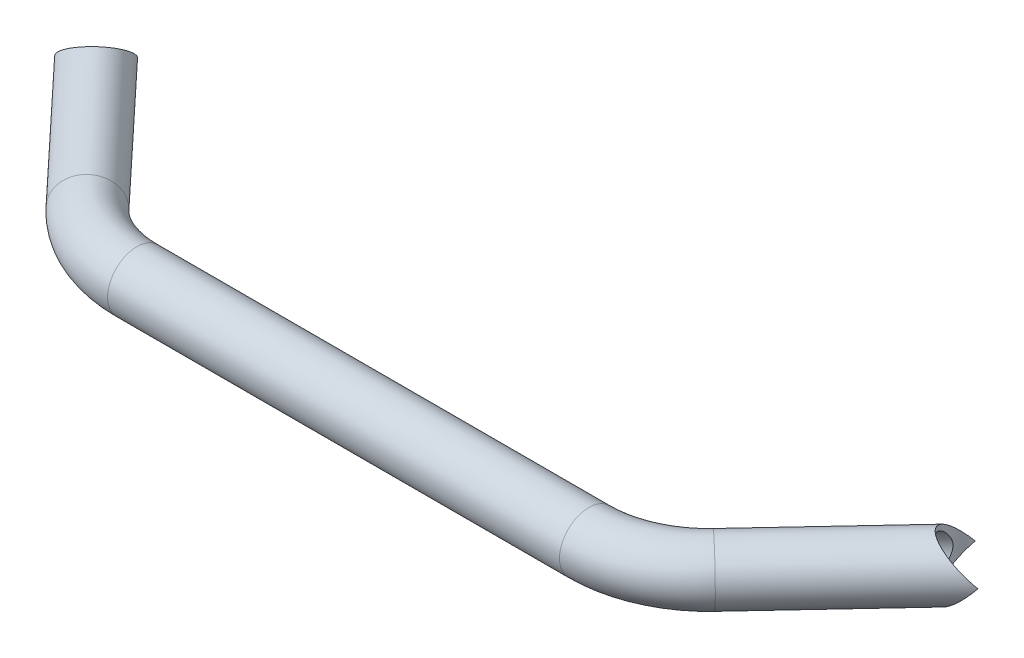
ISO-10303-21;
HEADER;
FILE_DESCRIPTION(('STEP AP214'),'2;1');
FILE_NAME('part.step','',(''),(''),'','','');
FILE_SCHEMA(('AUTOMOTIVE_DESIGN { 1 0 10303 214 1 1 1 1 }'));
ENDSEC;
DATA;
#1=APPLICATION_CONTEXT('core data for automotive mechanical design processes');
#2=APPLICATION_PROTOCOL_DEFINITION('international standard','automotive_design',2000,#1);
#3=PRODUCT_CONTEXT('',#1,'mechanical');
#4=PRODUCT('Part','Part','',(#3));
#5=PRODUCT_RELATED_PRODUCT_CATEGORY('part','',(#4));
#6=PRODUCT_DEFINITION_FORMATION('','',#4);
#7=PRODUCT_DEFINITION_CONTEXT('part definition',#1,'design');
#8=PRODUCT_DEFINITION('design','',#6,#7);
#9=PRODUCT_DEFINITION_SHAPE('','',#8);
#10=(LENGTH_UNIT() NAMED_UNIT(*) SI_UNIT(.MILLI.,.METRE.));
#11=(NAMED_UNIT(*) PLANE_ANGLE_UNIT() SI_UNIT($,.RADIAN.));
#12=(NAMED_UNIT(*) SI_UNIT($,.STERADIAN.) SOLID_ANGLE_UNIT());
#13=UNCERTAINTY_MEASURE_WITH_UNIT(LENGTH_MEASURE(1.E-05),#10,'distance_accuracy_value','');
#14=(GEOMETRIC_REPRESENTATION_CONTEXT(3) GLOBAL_UNCERTAINTY_ASSIGNED_CONTEXT((#13)) GLOBAL_UNIT_ASSIGNED_CONTEXT((#10,
#11,#12)) REPRESENTATION_CONTEXT('',''));
#15=CARTESIAN_POINT('',(0.,0.,0.));
#16=DIRECTION('',(0.,0.,1.));
#17=DIRECTION('',(1.,0.,0.));
#18=AXIS2_PLACEMENT_3D('',#15,#16,#17);
#19=CARTESIAN_POINT('',(-133.513784770512,0.,-15.1790258869227));
#20=DIRECTION('',(-0.683403377633146,0.,-0.730040973808736));
#21=DIRECTION('',(-0.730040973808736,0.,0.683403377633146));
#22=AXIS2_PLACEMENT_3D('',#19,#20,#21);
#23=CYLINDRICAL_SURFACE('',#22,12.5);
#24=CARTESIAN_POINT('',(-187.661320539916,0.,-73.0217598215196));
#25=DIRECTION('',(-0.483239162610188,0.707106781186547,-0.516216923124188));
#26=DIRECTION('',(-0.483239162610188,-0.707106781186547,-0.516216923124188));
#27=AXIS2_PLACEMENT_3D('',#24,#25,#26);
#28=ELLIPSE('',#27,17.6776695296637,12.5);
#29=CARTESIAN_POINT('',(-196.786832712525,0.,-64.4792176011055));
#30=VERTEX_POINT('',#29);
#31=CARTESIAN_POINT('',(-178.535808367306,0.,-81.5643020419338));
#32=VERTEX_POINT('',#31);
#33=EDGE_CURVE('E58',#30,#32,#28,.T.);
#34=ORIENTED_EDGE('',*,*,#33,.F.);
#35=CARTESIAN_POINT('',(-187.661320539916,0.,-73.0217598215196));
#36=DIRECTION('',(-0.483239162610188,-0.707106781186547,-0.516216923124188));
#37=DIRECTION('',(-0.483239162610188,0.707106781186547,-0.516216923124188));
#38=AXIS2_PLACEMENT_3D('',#35,#36,#37);
#39=ELLIPSE('',#38,17.6776695296637,12.5);
#40=EDGE_CURVE('E62',#32,#30,#39,.T.);
#41=ORIENTED_EDGE('',*,*,#40,.F.);
#42=EDGE_LOOP('',(#34,#41));
#43=FACE_BOUND('',#42,.T.);
#44=CARTESIAN_POINT('',(-133.513784770512,0.,-15.1790258869227));
#45=DIRECTION('',(-0.683403377633133,0.,-0.730040973808748));
#46=DIRECTION('',(-0.730040973808748,0.,0.683403377633133));
#47=AXIS2_PLACEMENT_3D('',#44,#45,#46);
#48=CIRCLE('',#47,12.5);
#49=CARTESIAN_POINT('',(-142.639296943121,0.,-6.63648366650837));
#50=VERTEX_POINT('',#49);
#51=EDGE_CURVE('E11',#50,#50,#48,.T.);
#52=ORIENTED_EDGE('',*,*,#51,.T.);
#53=EDGE_LOOP('',(#52));
#54=FACE_BOUND('',#53,.T.);
#55=ADVANCED_FACE('F34',(#43,#54),#23,.T.);
#56=CARTESIAN_POINT('',(-133.513784770512,0.,-15.1790258869227));
#57=DIRECTION('',(-0.683403377633146,0.,-0.730040973808736));
#58=DIRECTION('',(-0.730040973808736,0.,0.683403377633146));
#59=AXIS2_PLACEMENT_3D('',#56,#57,#58);
#60=CYLINDRICAL_SURFACE('',#59,10.5);
#61=CARTESIAN_POINT('',(-190.691683546217,0.,-60.8946455707986));
#62=CARTESIAN_POINT('',(-190.691678867242,0.183076877894322,-60.8946431981583));
#63=CARTESIAN_POINT('',(-190.683085642997,0.366193520833993,-60.8924870758773));
#64=CARTESIAN_POINT('',(-190.649082197047,0.730830359944528,-60.8840676127149));
#65=CARTESIAN_POINT('',(-190.623661925543,0.912349536355825,-60.8778018173895));
#66=CARTESIAN_POINT('',(-190.556981012901,1.27274647191603,-60.8617302066476));
#67=CARTESIAN_POINT('',(-190.515680187948,1.45161632507315,-60.8519154147103));
#68=CARTESIAN_POINT('',(-190.41872791826,1.80527300479625,-60.8295831532659));
#69=CARTESIAN_POINT('',(-190.363070757213,1.98005817464667,-60.8170646075194));
#70=CARTESIAN_POINT('',(-190.214499990628,2.39317857225525,-60.7849670826999));
#71=CARTESIAN_POINT('',(-190.115559688349,2.629282352519,-60.7645548291013));
#72=CARTESIAN_POINT('',(-189.89717656339,3.09171593856796,-60.7228452655316));
#73=CARTESIAN_POINT('',(-189.777722982499,3.31804053729898,-60.701547495615));
#74=CARTESIAN_POINT('',(-189.521541471281,3.76158603556164,-60.6602690731504));
#75=CARTESIAN_POINT('',(-189.384767099105,3.97878028748249,-60.6402921899981));
#76=CARTESIAN_POINT('',(-189.097021084997,4.40375175803055,-60.6036349244394));
#77=CARTESIAN_POINT('',(-188.946050176664,4.61152946243219,-60.5869543718346));
#78=CARTESIAN_POINT('',(-188.559012344029,5.11269527464846,-60.5518999671156));
#79=CARTESIAN_POINT('',(-188.316023804733,5.40095702601532,-60.5363465694721));
#80=CARTESIAN_POINT('',(-187.809109672135,5.95902012282276,-60.5200562720473));
#81=CARTESIAN_POINT('',(-187.545174773311,6.22881316319132,-60.5193259949202));
#82=CARTESIAN_POINT('',(-187.000313070078,6.74952567747122,-60.5362759102041));
#83=CARTESIAN_POINT('',(-186.719402721054,7.00046291636034,-60.5539385345394));
#84=CARTESIAN_POINT('',(-186.143442610168,7.48278379906874,-60.6108873145155));
#85=CARTESIAN_POINT('',(-185.84839840844,7.71417503471805,-60.6501650297149));
#86=CARTESIAN_POINT('',(-185.311653838395,8.10828342766437,-60.7422462910498));
#87=CARTESIAN_POINT('',(-185.072121979673,8.2750698646321,-60.7903265784011));
#88=CARTESIAN_POINT('',(-184.587552583054,8.59443434003217,-60.9030224238291));
#89=CARTESIAN_POINT('',(-184.342516192436,8.74701530574631,-60.9676345649011));
#90=CARTESIAN_POINT('',(-183.848866753886,9.03641227314824,-61.1145587891605));
#91=CARTESIAN_POINT('',(-183.600258505869,9.17324754499213,-61.1968488759009));
#92=CARTESIAN_POINT('',(-183.101105250075,9.42973405012039,-61.3802356454576));
#93=CARTESIAN_POINT('',(-182.850560608939,9.54938845634923,-61.4813288477977));
#94=CARTESIAN_POINT('',(-182.393639706652,9.75045283711552,-61.6836567073372));
#95=CARTESIAN_POINT('',(-182.187209543814,9.83489095057892,-61.7817684800896));
#96=CARTESIAN_POINT('',(-181.776018470762,9.98985408142831,-61.9915079037594));
#97=CARTESIAN_POINT('',(-181.571257227317,10.0603819449043,-62.1031327822856));
#98=CARTESIAN_POINT('',(-181.165027468443,10.1865433088686,-62.3398398074686));
#99=CARTESIAN_POINT('',(-180.963557832356,10.2421819821002,-62.4649172592592));
#100=CARTESIAN_POINT('',(-180.56552512045,10.3377366740758,-62.728236578923));
#101=CARTESIAN_POINT('',(-180.36896210069,10.3776525132613,-62.8664785971163));
#102=CARTESIAN_POINT('',(-179.981628906467,10.4412235969601,-63.1561090573689));
#103=CARTESIAN_POINT('',(-179.790888048294,10.4648064728236,-63.3075527027044));
#104=CARTESIAN_POINT('',(-179.417822775736,10.4949988922027,-63.6220648868246));
#105=CARTESIAN_POINT('',(-179.235498378845,10.5016084004411,-63.7851334497695));
#106=CARTESIAN_POINT('',(-178.880843494052,10.4977310780768,-64.1215929926601));
#107=CARTESIAN_POINT('',(-178.708512673741,10.4872448164555,-64.2949836288815));
#108=CARTESIAN_POINT('',(-178.375176918807,10.4493712785649,-64.6505639518116));
#109=CARTESIAN_POINT('',(-178.2141715678,10.4219846240063,-64.8327533146164));
#110=CARTESIAN_POINT('',(-177.915390251296,10.3533056204913,-65.1912159781894));
#111=CARTESIAN_POINT('',(-177.776777040389,10.3131239437921,-65.3670072705989));
#112=CARTESIAN_POINT('',(-177.510750927506,10.2191470603005,-65.7234443729141));
#113=CARTESIAN_POINT('',(-177.383341851558,10.1653472272677,-65.9040918138306));
#114=CARTESIAN_POINT('',(-177.140143355161,10.0448773020222,-66.2687712128298));
#115=CARTESIAN_POINT('',(-177.024350216447,9.97821134836499,-66.4528020654185));
#116=CARTESIAN_POINT('',(-176.804392135278,9.8327711405304,-66.8230898620992));
#117=CARTESIAN_POINT('',(-176.700231538205,9.75399238751347,-67.0093476094847));
#118=CARTESIAN_POINT('',(-176.49534678367,9.57818024841823,-67.3983052591088));
#119=CARTESIAN_POINT('',(-176.395618722391,9.4801761168201,-67.6010913917348));
#120=CARTESIAN_POINT('',(-176.209373960598,9.27197688007955,-68.0065070474837));
#121=CARTESIAN_POINT('',(-176.122862530318,9.16177694181388,-68.2091364762421));
#122=CARTESIAN_POINT('',(-175.882405436647,8.81424737752849,-68.8151217213007));
#123=CARTESIAN_POINT('',(-175.747534892699,8.55998616670185,-69.216578521075));
#124=CARTESIAN_POINT('',(-175.552594620589,8.0838202098739,-69.9037992227189));
#125=CARTESIAN_POINT('',(-175.482207051077,7.87043158409135,-70.19274529089));
#126=CARTESIAN_POINT('',(-175.364150215968,7.42432977950488,-70.7604373661672));
#127=CARTESIAN_POINT('',(-175.316491397739,7.19160777162733,-71.039178628348));
#128=CARTESIAN_POINT('',(-175.241241610902,6.7078048802031,-71.5839128877597));
#129=CARTESIAN_POINT('',(-175.213686128078,6.45669238967189,-71.8498825719006));
#130=CARTESIAN_POINT('',(-175.175893480546,5.9370483399469,-72.3654013650257));
#131=CARTESIAN_POINT('',(-175.165650332302,5.6685228324205,-72.6149561187113));
#132=CARTESIAN_POINT('',(-175.160044612395,5.18398429731532,-73.0331862286135));
#133=CARTESIAN_POINT('',(-175.161573590752,4.97186779883609,-73.2063535142342));
#134=CARTESIAN_POINT('',(-175.1709275164,4.53738573616562,-73.5392374603783));
#135=CARTESIAN_POINT('',(-175.178753000225,4.31501930008416,-73.6989529733746));
#136=CARTESIAN_POINT('',(-175.198873852476,3.86009720394399,-74.0017526466379));
#137=CARTESIAN_POINT('',(-175.211158623712,3.62756684061339,-74.1448751838282));
#138=CARTESIAN_POINT('',(-175.238057326688,3.15161932086739,-74.4111576192603));
#139=CARTESIAN_POINT('',(-175.252670038342,2.90820791507944,-74.5343279067639));
#140=CARTESIAN_POINT('',(-175.286220948771,2.33290340836182,-74.7904960025163));
#141=CARTESIAN_POINT('',(-175.305099358419,1.99692548613459,-74.9147542000733));
#142=CARTESIAN_POINT('',(-175.328520961974,1.48163623551212,-75.0600079699508));
#143=CARTESIAN_POINT('',(-175.335508751097,1.30812045755374,-75.101554524935));
#144=CARTESIAN_POINT('',(-175.347187989245,0.958037318220937,-75.1696291253003));
#145=CARTESIAN_POINT('',(-175.351879519855,0.781470065494233,-75.1961577042654));
#146=CARTESIAN_POINT('',(-175.358491485494,0.425123929773104,-75.233266855154));
#147=CARTESIAN_POINT('',(-175.360388691053,0.245330563398764,-75.2437137707724));
#148=CARTESIAN_POINT('',(-175.361123752747,-0.114450193296088,-75.2477795580482));
#149=CARTESIAN_POINT('',(-175.359961707658,-0.294437577164685,-75.2413989730249));
#150=CARTESIAN_POINT('',(-175.354707747775,-0.653194659365994,-75.2120790055574));
#151=CARTESIAN_POINT('',(-175.350612680885,-0.831962838589899,-75.1891218081413));
#152=CARTESIAN_POINT('',(-175.339939591991,-1.18670607593055,-75.1275934800281));
#153=CARTESIAN_POINT('',(-175.333361160958,-1.36268066894416,-75.0890197770979));
#154=CARTESIAN_POINT('',(-175.316652642258,-1.75117754243921,-74.9870644266866));
#155=CARTESIAN_POINT('',(-175.306052703388,-1.96271224915505,-74.9200042967857));
#156=CARTESIAN_POINT('',(-175.283552632303,-2.37897456029455,-74.7672692995831));
#157=CARTESIAN_POINT('',(-175.271651407371,-2.58369625261613,-74.681578727317));
#158=CARTESIAN_POINT('',(-175.247993089012,-2.9863308311321,-74.494250045823));
#159=CARTESIAN_POINT('',(-175.236236470253,-3.18422388848255,-74.3925695955974));
#160=CARTESIAN_POINT('',(-175.214245778,-3.57257641828394,-74.1759678849083));
#161=CARTESIAN_POINT('',(-175.204011304257,-3.76303783514404,-74.0610501193693));
#162=CARTESIAN_POINT('',(-175.180923324275,-4.24900982005791,-73.7476801140241));
#163=CARTESIAN_POINT('',(-175.170181990582,-4.53899423048875,-73.5404729802091));
#164=CARTESIAN_POINT('',(-175.15967473781,-5.10183883608191,-73.1036550920982));
#165=CARTESIAN_POINT('',(-175.15991487926,-5.37468949218075,-72.8740320365085));
#166=CARTESIAN_POINT('',(-175.174677743999,-5.90412766968026,-72.3965487633862));
#167=CARTESIAN_POINT('',(-175.189218161028,-6.16069462458362,-72.1486663049971));
#168=CARTESIAN_POINT('',(-175.235470293456,-6.65713267252745,-71.6383172605536));
#169=CARTESIAN_POINT('',(-175.2671785286,-6.89700713834586,-71.3758536400621));
#170=CARTESIAN_POINT('',(-175.351684981279,-7.36678551933799,-70.830551444757));
#171=CARTESIAN_POINT('',(-175.405118498101,-7.59613415325329,-70.5473310043784));
#172=CARTESIAN_POINT('',(-175.535716760147,-8.03502631273067,-69.971014895681));
#173=CARTESIAN_POINT('',(-175.612885961426,-8.24456610978512,-69.6779173822826));
#174=CARTESIAN_POINT('',(-175.793171749326,-8.64109198506292,-69.0856956265515));
#175=CARTESIAN_POINT('',(-175.8962162069,-8.82813865566092,-68.7865902293643));
#176=CARTESIAN_POINT('',(-176.130482008721,-9.1775162689712,-68.1850472376667));
#177=CARTESIAN_POINT('',(-176.261687197806,-9.33986129157712,-67.8826116475898));
#178=CARTESIAN_POINT('',(-176.506029784667,-9.58810212602173,-67.3772455620762));
#179=CARTESIAN_POINT('',(-176.611052611928,-9.68164046609567,-67.1741060235107));
#180=CARTESIAN_POINT('',(-176.834805365917,-9.85502249288054,-66.7695639869644));
#181=CARTESIAN_POINT('',(-176.953531547363,-9.93486990671788,-66.5681610304529));
#182=CARTESIAN_POINT('',(-177.204666767485,-10.0798017649783,-66.1687300962937));
#183=CARTESIAN_POINT('',(-177.337068893799,-10.14489361481,-65.9707004720237));
#184=CARTESIAN_POINT('',(-177.615339937289,-10.2593959610595,-65.5795918516145));
#185=CARTESIAN_POINT('',(-177.761209267625,-10.3088059761675,-65.3865130075927));
#186=CARTESIAN_POINT('',(-178.066630766605,-10.3913422320652,-65.0060407277297));
#187=CARTESIAN_POINT('',(-178.226252855759,-10.4243787012588,-64.8186838074609));
#188=CARTESIAN_POINT('',(-178.557518878528,-10.4731643222639,-64.4525276047794));
#189=CARTESIAN_POINT('',(-178.729162775524,-10.4889135267296,-64.2737282963033));
#190=CARTESIAN_POINT('',(-179.083141126962,-10.5028247851055,-63.9263586068995));
#191=CARTESIAN_POINT('',(-179.265474307743,-10.5009889301131,-63.7577870121597));
#192=CARTESIAN_POINT('',(-179.639265310268,-10.4797692417687,-63.4322843629716));
#193=CARTESIAN_POINT('',(-179.830722664232,-10.4603863071113,-63.2753527128151));
#194=CARTESIAN_POINT('',(-180.204973314672,-10.4067416127094,-62.9866170838266));
#195=CARTESIAN_POINT('',(-180.38718844542,-10.3738312472057,-62.8538078785635));
#196=CARTESIAN_POINT('',(-180.756474036464,-10.2940243643562,-62.5995061821067));
#197=CARTESIAN_POINT('',(-180.943546124046,-10.2471231027874,-62.4780175480144));
#198=CARTESIAN_POINT('',(-181.321018968324,-10.1400130358492,-62.2468095574325));
#199=CARTESIAN_POINT('',(-181.511418695873,-10.0798082800873,-62.1370866345031));
#200=CARTESIAN_POINT('',(-181.894331246043,-9.94682745650607,-61.9294517412268));
#201=CARTESIAN_POINT('',(-182.086844836234,-9.87404667061684,-61.8315442270899));
#202=CARTESIAN_POINT('',(-182.484553156678,-9.71190718766413,-61.641841550131));
#203=CARTESIAN_POINT('',(-182.689800167527,-9.62180458869602,-61.550791740449));
#204=CARTESIAN_POINT('',(-183.099913673619,-9.42935376753995,-61.3816202199788));
#205=CARTESIAN_POINT('',(-183.304779987012,-9.3270007331208,-61.3035036185365));
#206=CARTESIAN_POINT('',(-183.917089721652,-9.00294696921946,-61.0878696310061));
#207=CARTESIAN_POINT('',(-184.322332481553,-8.76421509776356,-60.9690266695438));
#208=CARTESIAN_POINT('',(-185.015126928304,-8.31529606491265,-60.8012848711557));
#209=CARTESIAN_POINT('',(-185.30599937166,-8.11370660986526,-60.7422446981257));
#210=CARTESIAN_POINT('',(-185.87750108431,-7.69132237859936,-60.6463055712684));
#211=CARTESIAN_POINT('',(-186.158125813372,-7.47051923289827,-60.6094163222196));
#212=CARTESIAN_POINT('',(-186.707065128235,-7.01076302518045,-60.555177714038));
#213=CARTESIAN_POINT('',(-186.975350906849,-6.77177063745254,-60.5378720542575));
#214=CARTESIAN_POINT('',(-187.496329313863,-6.27689224722757,-60.5201344725519));
#215=CARTESIAN_POINT('',(-187.749026087072,-6.02101077298336,-60.519698045958));
#216=CARTESIAN_POINT('',(-188.194524626388,-5.53720438671757,-60.5314995111907));
#217=CARTESIAN_POINT('',(-188.390221660098,-5.31188528718585,-60.541603155999));
#218=CARTESIAN_POINT('',(-188.766493263555,-4.8492819642937,-60.5692837910631));
#219=CARTESIAN_POINT('',(-188.947065256049,-4.61199571276436,-60.5868620518787));
#220=CARTESIAN_POINT('',(-189.289602604286,-4.12547646149199,-60.6270694319571));
#221=CARTESIAN_POINT('',(-189.451609854276,-3.87627223427793,-60.6496868256066));
#222=CARTESIAN_POINT('',(-189.753242754523,-3.36506680529524,-60.6971036062356));
#223=CARTESIAN_POINT('',(-189.892883504728,-3.10307439425037,-60.7219015034571));
#224=CARTESIAN_POINT('',(-190.176004671887,-2.49819950947704,-60.776268694794));
#225=CARTESIAN_POINT('',(-190.311711858855,-2.15147329940105,-60.8054803221437));
#226=CARTESIAN_POINT('',(-190.472455686747,-1.61868474547546,-60.8418360483723));
#227=CARTESIAN_POINT('',(-190.518867430946,-1.43921887673077,-60.8527014984649));
#228=CARTESIAN_POINT('',(-190.595951202649,-1.07680123117845,-60.8710591156951));
#229=CARTESIAN_POINT('',(-190.626633576411,-0.893851828083832,-60.878553499809));
#230=CARTESIAN_POINT('',(-190.663027153758,-0.592148310089239,-60.8875124507651));
#231=CARTESIAN_POINT('',(-190.673752418896,-0.4740147572821,-60.8901766723678));
#232=CARTESIAN_POINT('',(-190.688082977137,-0.237259775383578,-60.8937442103728));
#233=CARTESIAN_POINT('',(-190.691686578306,-0.118638237064736,-60.8946471083268));
#234=CARTESIAN_POINT('',(-190.691683546217,0.,-60.8946455707986));
#235=B_SPLINE_CURVE_WITH_KNOTS('',3,(#61,#62,#63,#64,#65,#66,#67,#68,#69,#70,#71,#72,#73,#74,
#75,#76,#77,#78,#79,#80,#81,#82,#83,#84,#85,#86,#87,#88,#89,#90,#91,#92,#93,#94,#95,#96,#97,#98,
#99,#100,#101,#102,#103,#104,#105,#106,#107,#108,#109,#110,#111,#112,#113,#114,#115,#116,#117,
#118,#119,#120,#121,#122,#123,#124,#125,#126,#127,#128,#129,#130,#131,#132,#133,#134,#135,#136,
#137,#138,#139,#140,#141,#142,#143,#144,#145,#146,#147,#148,#149,#150,#151,#152,#153,#154,#155,
#156,#157,#158,#159,#160,#161,#162,#163,#164,#165,#166,#167,#168,#169,#170,#171,#172,#173,#174,
#175,#176,#177,#178,#179,#180,#181,#182,#183,#184,#185,#186,#187,#188,#189,#190,#191,#192,#193,
#194,#195,#196,#197,#198,#199,#200,#201,#202,#203,#204,#205,#206,#207,#208,#209,#210,#211,#212,
#213,#214,#215,#216,#217,#218,#219,#220,#221,#222,#223,#224,#225,#226,#227,#228,#229,#230,#231,
#232,#233,#234),.UNSPECIFIED.,.T.,.F.,(4,2,2,2,2,2,2,2,2,2,2,2,2,2,2,2,2,2,2,2,2,2,2,2,2,2,2,2,
2,2,2,2,2,2,2,2,2,2,2,2,2,2,2,2,2,2,2,2,2,2,2,2,2,2,2,2,2,2,2,2,2,2,2,2,2,2,2,2,2,2,2,2,2,2,2,2,
2,2,2,2,2,2,2,2,2,2,4),(0.,0.549091256839842,1.09851074961638,1.64932972926554,2.20036836989753,
2.96953114409327,3.7390985454419,4.51077488289792,5.28241136622088,6.41291946104588,
7.54393263166926,8.6738664991733,9.80335945340993,10.6900265463577,11.5765105199976,
12.461897776409,13.3471213095305,14.0773771447081,14.807483411415,15.5373356972302,
16.2671963178902,17.000270489667,17.7333461850492,18.4663974826974,19.199421815364,
19.8810072502413,20.5628245388047,21.2444228763717,21.9262749820215,22.664500353997,
23.4030193348969,24.8800427641957,25.9769004679534,27.0742618622434,28.1735556288362,
29.2724693767433,30.0934352489131,30.9144710842239,31.7335684226332,32.5522378713045,
33.624072355202,34.1591875434232,34.6942837179685,35.233803567874,35.7733059982024,
36.3133890992234,36.8535611948803,37.5189930802009,38.1849880968664,38.8527773146055,
39.5203906245817,40.5885153614679,41.6572295891509,42.7272678032673,43.7970891807186,
44.9007459737449,46.0046100900789,47.1054306212101,48.2056213169439,48.9461617646973,
49.686500291471,50.4264664361795,51.1664552898745,51.9104576131398,52.6544576702955,
53.3983692570454,54.1422427456277,54.8250774272517,55.5081439174457,56.1910027667014,
56.8741183582353,57.5992129216487,58.3245932582503,59.7750437519858,60.8501874587455,
61.9258018651935,63.0038117230175,64.0815337129322,64.9767118523642,65.8720422179806,
66.7653105933496,67.6579733450148,68.7738775313136,69.330352756048,69.8864614787354,
70.2422013654107,70.5980257570454),.UNSPECIFIED.);
#236=CARTESIAN_POINT('',(-190.691683546217,0.,-60.8946455707986));
#237=VERTEX_POINT('',#236);
#238=EDGE_CURVE('E67',#237,#237,#235,.T.);
#239=ORIENTED_EDGE('',*,*,#238,.T.);
#240=EDGE_LOOP('',(#239));
#241=FACE_BOUND('',#240,.T.);
#242=CARTESIAN_POINT('',(-133.513784770512,0.,-15.1790258869227));
#243=DIRECTION('',(-0.683403377633133,0.,-0.730040973808748));
#244=DIRECTION('',(-0.730040973808748,0.,0.683403377633133));
#245=AXIS2_PLACEMENT_3D('',#242,#243,#244);
#246=CIRCLE('',#245,10.5);
#247=CARTESIAN_POINT('',(-141.179214995504,0.,-8.00329042177465));
#248=VERTEX_POINT('',#247);
#249=EDGE_CURVE('E41',#248,#248,#246,.T.);
#250=ORIENTED_EDGE('',*,*,#249,.F.);
#251=EDGE_LOOP('',(#250));
#252=FACE_BOUND('',#251,.T.);
#253=ADVANCED_FACE('F107',(#241,#252),#60,.F.);
#254=CARTESIAN_POINT('',(-96.3165172350745,0.,-50.0000005779971));
#255=DIRECTION('',(0.,-1.,0.));
#256=DIRECTION('',(0.,0.,-1.));
#257=AXIS2_PLACEMENT_3D('',#254,#255,#256);
#258=TOROIDAL_SURFACE('',#257,50.9523011309533,12.5);
#259=CARTESIAN_POINT('',(-96.3165172350743,0.,0.952300552956174));
#260=DIRECTION('',(-1.,0.,0.));
#261=DIRECTION('',(0.,0.,1.));
#262=AXIS2_PLACEMENT_3D('',#259,#260,#261);
#263=CIRCLE('',#262,12.5);
#264=CARTESIAN_POINT('',(-96.3165172350743,0.,13.4523005529561));
#265=VERTEX_POINT('',#264);
#266=EDGE_CURVE('E156',#265,#265,#263,.T.);
#267=CARTESIAN_POINT('',(-96.3165172350745,0.,-50.0000005779971));
#268=DIRECTION('',(0.,-1.,0.));
#269=DIRECTION('',(0.,0.,-1.));
#270=AXIS2_PLACEMENT_3D('',#267,#268,#269);
#271=CIRCLE('',#270,63.4523011309533);
#272=EDGE_CURVE('',#265,#50,#271,.T.);
#273=ORIENTED_EDGE('',*,*,#266,.T.);
#274=ORIENTED_EDGE('',*,*,#51,.F.);
#275=ORIENTED_EDGE('',*,*,#272,.T.);
#276=ORIENTED_EDGE('',*,*,#272,.F.);
#277=EDGE_LOOP('',(#273,#275,#274,#276));
#278=FACE_BOUND('',#277,.T.);
#279=ADVANCED_FACE('F111',(#278),#258,.T.);
#280=CARTESIAN_POINT('',(-96.3165172350745,0.,-50.0000005779971));
#281=DIRECTION('',(0.,-1.,0.));
#282=DIRECTION('',(0.,0.,-1.));
#283=AXIS2_PLACEMENT_3D('',#280,#281,#282);
#284=TOROIDAL_SURFACE('',#283,50.9523011309533,10.5);
#285=CARTESIAN_POINT('',(-96.3165172350743,0.,0.952300552956174));
#286=DIRECTION('',(-1.,0.,0.));
#287=DIRECTION('',(0.,0.,1.));
#288=AXIS2_PLACEMENT_3D('',#285,#286,#287);
#289=CIRCLE('',#288,10.5);
#290=CARTESIAN_POINT('',(-96.3165172350743,0.,11.4523005529562));
#291=VERTEX_POINT('',#290);
#292=EDGE_CURVE('E150',#291,#291,#289,.T.);
#293=CARTESIAN_POINT('',(-96.3165172350745,0.,-50.0000005779971));
#294=DIRECTION('',(0.,-1.,0.));
#295=DIRECTION('',(0.,0.,-1.));
#296=AXIS2_PLACEMENT_3D('',#293,#294,#295);
#297=CIRCLE('',#296,61.4523011309533);
#298=EDGE_CURVE('',#291,#248,#297,.T.);
#299=ORIENTED_EDGE('',*,*,#292,.F.);
#300=ORIENTED_EDGE('',*,*,#249,.T.);
#301=ORIENTED_EDGE('',*,*,#298,.T.);
#302=ORIENTED_EDGE('',*,*,#298,.F.);
#303=EDGE_LOOP('',(#299,#301,#300,#302));
#304=FACE_BOUND('',#303,.T.);
#305=ADVANCED_FACE('F116',(#304),#284,.F.);
#306=CARTESIAN_POINT('',(96.3165173963226,0.,0.95230055295617));
#307=DIRECTION('',(-1.,0.,0.));
#308=DIRECTION('',(0.,0.,1.));
#309=AXIS2_PLACEMENT_3D('',#306,#307,#308);
#310=CYLINDRICAL_SURFACE('',#309,12.5);
#311=CARTESIAN_POINT('',(96.3165173963226,0.,0.95230055295617));
#312=DIRECTION('',(-1.,0.,0.));
#313=DIRECTION('',(0.,0.,1.));
#314=AXIS2_PLACEMENT_3D('',#311,#312,#313);
#315=CIRCLE('',#314,12.5);
#316=CARTESIAN_POINT('',(96.3165173963225,0.,13.4523005529561));
#317=VERTEX_POINT('',#316);
#318=EDGE_CURVE('E146',#317,#317,#315,.T.);
#319=ORIENTED_EDGE('',*,*,#318,.T.);
#320=EDGE_LOOP('',(#319));
#321=FACE_BOUND('',#320,.T.);
#322=ORIENTED_EDGE('',*,*,#266,.F.);
#323=EDGE_LOOP('',(#322));
#324=FACE_BOUND('',#323,.T.);
#325=ADVANCED_FACE('F124',(#321,#324),#310,.T.);
#326=CARTESIAN_POINT('',(96.3165173963226,0.,0.95230055295617));
#327=DIRECTION('',(-1.,0.,0.));
#328=DIRECTION('',(0.,0.,1.));
#329=AXIS2_PLACEMENT_3D('',#326,#327,#328);
#330=CYLINDRICAL_SURFACE('',#329,10.5);
#331=CARTESIAN_POINT('',(96.3165173963226,0.,0.95230055295617));
#332=DIRECTION('',(-1.,0.,0.));
#333=DIRECTION('',(0.,0.,1.));
#334=AXIS2_PLACEMENT_3D('',#331,#332,#333);
#335=CIRCLE('',#334,10.5);
#336=CARTESIAN_POINT('',(96.3165173963225,0.,11.4523005529562));
#337=VERTEX_POINT('',#336);
#338=EDGE_CURVE('E145',#337,#337,#335,.T.);
#339=ORIENTED_EDGE('',*,*,#338,.F.);
#340=EDGE_LOOP('',(#339));
#341=FACE_BOUND('',#340,.T.);
#342=ORIENTED_EDGE('',*,*,#292,.T.);
#343=EDGE_LOOP('',(#342));
#344=FACE_BOUND('',#343,.T.);
#345=ADVANCED_FACE('F128',(#341,#344),#330,.F.);
#346=CARTESIAN_POINT('',(96.3165173963228,0.,-50.0000005779971));
#347=DIRECTION('',(0.,-1.,0.));
#348=DIRECTION('',(0.,0.,-1.));
#349=AXIS2_PLACEMENT_3D('',#346,#347,#348);
#350=TOROIDAL_SURFACE('',#349,50.9523011309533,12.5);
#351=CARTESIAN_POINT('',(133.513784983495,0.,-15.1790259421878));
#352=DIRECTION('',(-0.683403376548501,0.,0.73004097482409));
#353=DIRECTION('',(0.73004097482409,0.,0.683403376548501));
#354=AXIS2_PLACEMENT_3D('',#351,#352,#353);
#355=CIRCLE('',#354,12.5);
#356=CARTESIAN_POINT('',(142.639297168796,0.,-6.63648373533161));
#357=VERTEX_POINT('',#356);
#358=EDGE_CURVE('E147',#357,#357,#355,.T.);
#359=CARTESIAN_POINT('',(96.3165173963228,0.,-50.0000005779971));
#360=DIRECTION('',(0.,-1.,0.));
#361=DIRECTION('',(0.,0.,-1.));
#362=AXIS2_PLACEMENT_3D('',#359,#360,#361);
#363=CIRCLE('',#362,63.4523011309533);
#364=EDGE_CURVE('',#357,#317,#363,.T.);
#365=ORIENTED_EDGE('',*,*,#358,.T.);
#366=ORIENTED_EDGE('',*,*,#318,.F.);
#367=ORIENTED_EDGE('',*,*,#364,.T.);
#368=ORIENTED_EDGE('',*,*,#364,.F.);
#369=EDGE_LOOP('',(#365,#367,#366,#368));
#370=FACE_BOUND('',#369,.T.);
#371=ADVANCED_FACE('F132',(#370),#350,.T.);
#372=CARTESIAN_POINT('',(96.3165173963228,0.,-50.0000005779971));
#373=DIRECTION('',(0.,-1.,0.));
#374=DIRECTION('',(0.,0.,-1.));
#375=AXIS2_PLACEMENT_3D('',#372,#373,#374);
#376=TOROIDAL_SURFACE('',#375,50.9523011309533,10.5);
#377=CARTESIAN_POINT('',(133.513784983495,0.,-15.1790259421878));
#378=DIRECTION('',(-0.683403376548501,0.,0.73004097482409));
#379=DIRECTION('',(0.73004097482409,0.,0.683403376548501));
#380=AXIS2_PLACEMENT_3D('',#377,#378,#379);
#381=CIRCLE('',#380,10.5);
#382=CARTESIAN_POINT('',(141.179215219148,0.,-8.0032904884286));
#383=VERTEX_POINT('',#382);
#384=EDGE_CURVE('E86',#383,#383,#381,.T.);
#385=CARTESIAN_POINT('',(96.3165173963228,0.,-50.0000005779971));
#386=DIRECTION('',(0.,-1.,0.));
#387=DIRECTION('',(0.,0.,-1.));
#388=AXIS2_PLACEMENT_3D('',#385,#386,#387);
#389=CIRCLE('',#388,61.4523011309533);
#390=EDGE_CURVE('',#383,#337,#389,.T.);
#391=ORIENTED_EDGE('',*,*,#384,.F.);
#392=ORIENTED_EDGE('',*,*,#338,.T.);
#393=ORIENTED_EDGE('',*,*,#390,.T.);
#394=ORIENTED_EDGE('',*,*,#390,.F.);
#395=EDGE_LOOP('',(#391,#393,#392,#394));
#396=FACE_BOUND('',#395,.T.);
#397=ADVANCED_FACE('F103',(#396),#376,.F.);
#398=CARTESIAN_POINT('',(133.513784983495,0.,-15.1790259421878));
#399=DIRECTION('',(0.683403376548501,0.,-0.73004097482409));
#400=DIRECTION('',(-0.73004097482409,0.,-0.683403376548501));
#401=AXIS2_PLACEMENT_3D('',#398,#399,#400);
#402=CYLINDRICAL_SURFACE('',#401,10.5);
#403=CARTESIAN_POINT('',(175.360823095494,0.,-75.2461164855601));
#404=CARTESIAN_POINT('',(175.360821036451,-0.183076877846344,-75.2461116603586));
#405=CARTESIAN_POINT('',(175.359236066196,-0.366193520738043,-75.2373949961185));
#406=CARTESIAN_POINT('',(175.353076411111,-0.730830359752798,-75.2029105018465));
#407=CARTESIAN_POINT('',(175.348499939654,-0.912349536116287,-75.1771324820785));
#408=CARTESIAN_POINT('',(175.336858868019,-1.27274647158129,-75.1095371698742));
#409=CARTESIAN_POINT('',(175.329787959747,-1.45161632469102,-75.0676791892959));
#410=CARTESIAN_POINT('',(175.31389533194,-1.80527300432006,-74.9694656623439));
#411=CARTESIAN_POINT('',(175.305072915324,-1.98005817412381,-74.9131043411457));
#412=CARTESIAN_POINT('',(175.282838937382,-2.39317857164411,-74.762740868186));
#413=CARTESIAN_POINT('',(175.268993191685,-2.62928235186592,-74.6626701989775));
#414=CARTESIAN_POINT('',(175.241770087904,-3.09171593783215,-74.4420125918839));
#415=CARTESIAN_POINT('',(175.228392980053,-3.31804053652238,-74.3214148888672));
#416=CARTESIAN_POINT('',(175.204091735939,-3.76158603470557,-74.0630695301564));
#417=CARTESIAN_POINT('',(175.193174422303,-3.97878028658772,-73.9252757821043));
#418=CARTESIAN_POINT('',(175.175565004697,-4.40375175706109,-73.6357392004091));
#419=CARTESIAN_POINT('',(175.168872682541,-4.61152946142675,-73.4839970875505));
#420=CARTESIAN_POINT('',(175.159407921182,-5.11269527364794,-73.0954903135071));
#421=CARTESIAN_POINT('',(175.159906072204,-5.40095702505191,-72.8520050156564));
#422=CARTESIAN_POINT('',(175.177066808495,-5.9590201219317,-72.3451196037362));
#423=CARTESIAN_POINT('',(175.193736615429,-6.2288131623355,-72.0817106409474));
#424=CARTESIAN_POINT('',(175.246566755303,-6.74952567668544,-71.5391513799647));
#425=CARTESIAN_POINT('',(175.282708473645,-7.00046291560935,-71.2600163432839));
#426=CARTESIAN_POINT('',(175.377500474161,-7.48278379838748,-70.6890630268076));
#427=CARTESIAN_POINT('',(175.436141967731,-7.71417503407174,-70.3972497386626));
#428=CARTESIAN_POINT('',(175.563404959514,-8.108283427081,-69.8677425874787));
#429=CARTESIAN_POINT('',(175.627170524949,-8.27506986407663,-69.6319011618268));
#430=CARTESIAN_POINT('',(175.771563893686,-8.59443433953262,-69.1558146057893));
#431=CARTESIAN_POINT('',(175.852188211786,-8.74701530527478,-68.9155703949399));
#432=CARTESIAN_POINT('',(176.031334063566,-9.03641227273253,-68.4326798693474));
#433=CARTESIAN_POINT('',(176.129833332233,-9.17324754460423,-68.1900368940826));
#434=CARTESIAN_POINT('',(176.345725230592,-9.42973404978746,-67.7040581205683));
#435=CARTESIAN_POINT('',(176.463114363208,-9.54938845604347,-67.4607224587307));
#436=CARTESIAN_POINT('',(176.695122211552,-9.75045283685203,-67.0181327705971));
#437=CARTESIAN_POINT('',(176.80662838849,-9.83489095033161,-66.8186191004091));
#438=CARTESIAN_POINT('',(177.043017186066,-9.98985408121385,-66.422148343857));
#439=CARTESIAN_POINT('',(177.167897062309,-10.0603819447065,-66.2251907422318));
#440=CARTESIAN_POINT('',(177.430867757018,-10.1865433087042,-65.8354482034785));
#441=CARTESIAN_POINT('',(177.568953964701,-10.2421819819527,-65.6426618386467));
#442=CARTESIAN_POINT('',(177.857938723958,-10.3377366739614,-65.2628527908379));
#443=CARTESIAN_POINT('',(178.00883742183,-10.3776525131633,-65.0758301737067));
#444=CARTESIAN_POINT('',(178.323370784787,-10.4412235968939,-64.7084317925604));
#445=CARTESIAN_POINT('',(178.487058600557,-10.4648064727729,-64.5280889200501));
#446=CARTESIAN_POINT('',(178.82547903163,-10.494998892181,-64.1765676213891));
#447=CARTESIAN_POINT('',(179.000211669888,-10.501608400433,-64.0053892142865));
#448=CARTESIAN_POINT('',(179.35931811651,-10.4977310780934,-63.6736850217614));
#449=CARTESIAN_POINT('',(179.543691603809,-10.4872448164833,-63.5131588819953));
#450=CARTESIAN_POINT('',(179.920471891985,-10.4493712786119,-63.203987883923));
#451=CARTESIAN_POINT('',(180.11287839711,-10.4219846240615,-63.0553425887861));
#452=CARTESIAN_POINT('',(180.490256940214,-10.3533056205611,-62.7808408738718));
#453=CARTESIAN_POINT('',(180.674803209156,-10.3131239438696,-62.6541172559252));
#454=CARTESIAN_POINT('',(181.048001385217,-10.2191470603923,-62.4121659756433));
#455=CARTESIAN_POINT('',(181.23665466759,-10.165347227366,-62.2969422385302));
#456=CARTESIAN_POINT('',(181.616572424353,-10.0448773021318,-62.0783122524724));
#457=CARTESIAN_POINT('',(181.807836040761,-9.97821134847961,-61.9749022204772));
#458=CARTESIAN_POINT('',(182.191817996577,-9.83277114065322,-61.7798318038257));
#459=CARTESIAN_POINT('',(182.384536851086,-9.75399238763956,-61.688175808053));
#460=CARTESIAN_POINT('',(182.78615442329,-9.57818024855531,-61.509376642708));
#461=CARTESIAN_POINT('',(182.995073521506,-9.48017611696565,-61.4232330870198));
#462=CARTESIAN_POINT('',(183.411884560814,-9.27197688024148,-61.2641182771907));
#463=CARTESIAN_POINT('',(183.619776060337,-9.16177694198372,-61.1911522755984));
#464=CARTESIAN_POINT('',(184.240294094799,-8.81424737772107,-60.9911645260304));
#465=CARTESIAN_POINT('',(184.649768318534,-8.55998616690813,-60.8830512253605));
#466=CARTESIAN_POINT('',(185.348344664246,-8.08382021011624,-60.7338363080036));
#467=CARTESIAN_POINT('',(185.641302179578,-7.87043158435836,-60.6826490592306));
#468=CARTESIAN_POINT('',(186.215541752374,-7.42432977982206,-60.6022710673585));
#469=CARTESIAN_POINT('',(186.496818386547,-7.19160777197,-60.5730904361192));
#470=CARTESIAN_POINT('',(187.045328252668,-6.70780488059741,-60.5339130132293));
#471=CARTESIAN_POINT('',(187.312535883022,-6.45669239009235,-60.5239500933873));
#472=CARTESIAN_POINT('',(187.829424666962,-5.93704834042083,-60.5202224648025));
#473=CARTESIAN_POINT('',(188.079111847405,-5.66852283292173,-60.5264521576344));
#474=CARTESIAN_POINT('',(188.496801806494,-5.18398429781012,-60.5484282122246));
#475=CARTESIAN_POINT('',(188.669491652229,-4.97186779929394,-60.5613689914941));
#476=CARTESIAN_POINT('',(189.00103494653,-4.53738573654614,-60.5926461643485));
#477=CARTESIAN_POINT('',(189.159887214695,-4.31501930042429,-60.6109830176564));
#478=CARTESIAN_POINT('',(189.460701919352,-3.8600972042009,-60.651020553661));
#479=CARTESIAN_POINT('',(189.602703347856,-3.62756684082749,-60.6727131920096));
#480=CARTESIAN_POINT('',(189.866633448516,-3.15161932099438,-60.7171066329981));
#481=CARTESIAN_POINT('',(189.988572567763,-2.90820791516215,-60.7398069030615));
#482=CARTESIAN_POINT('',(190.241971816919,-2.33290340830423,-60.7901713488025));
#483=CARTESIAN_POINT('',(190.364715286633,-1.9969254859787,-60.8171997533354));
#484=CARTESIAN_POINT('',(190.50810917616,-1.48163623521005,-60.8501454907666));
#485=CARTESIAN_POINT('',(190.549104732056,-1.30812045720312,-60.8598568152742));
#486=CARTESIAN_POINT('',(190.616261374412,-0.95803731777433,-60.8759981040124));
#487=CARTESIAN_POINT('',(190.642422987919,-0.781470065000193,-60.8824281848237));
#488=CARTESIAN_POINT('',(190.679015565491,-0.425123929187263,-60.891471991165));
#489=CARTESIAN_POINT('',(190.689314695241,-0.245330562768586,-60.8940537271742));
#490=CARTESIAN_POINT('',(190.693323184114,0.114450194012861,-60.8950552053173));
#491=CARTESIAN_POINT('',(190.687033078862,0.294437577923716,-60.8934750818275));
#492=CARTESIAN_POINT('',(190.658123223384,0.653194660207751,-60.8862997877012));
#493=CARTESIAN_POINT('',(190.63548590472,0.831962839472119,-60.8807002974684));
#494=CARTESIAN_POINT('',(190.574794970965,1.18670607689195,-60.8659944974905));
#495=CARTESIAN_POINT('',(190.536738816198,1.36268066994428,-60.8568876100454));
#496=CARTESIAN_POINT('',(190.436106644958,1.75117754355257,-60.8334945726293));
#497=CARTESIAN_POINT('',(190.369891119429,1.9627122503418,-60.8184971091451));
#498=CARTESIAN_POINT('',(190.218971527522,2.37897456162423,-60.7859777398982));
#499=CARTESIAN_POINT('',(190.134251862372,2.58369625401535,-60.7684537085302));
#500=CARTESIAN_POINT('',(189.948890180943,2.9863308326664,-60.7324982077791));
#501=CARTESIAN_POINT('',(189.848205884471,3.18422389008238,-60.7140644209282));
#502=CARTESIAN_POINT('',(189.633524915264,3.57257642001067,-60.6778432513082));
#503=CARTESIAN_POINT('',(189.519531756237,3.76303783693213,-60.6600556995437));
#504=CARTESIAN_POINT('',(189.208365302584,4.24900982190566,-60.6163606969461));
#505=CARTESIAN_POINT('',(189.002316922751,4.53899423233714,-60.5919837050146));
#506=CARTESIAN_POINT('',(188.567141776477,5.10183883792963,-60.5527044247462));
#507=CARTESIAN_POINT('',(188.338002335991,5.37468949402718,-60.5378073728588));
#508=CARTESIAN_POINT('',(187.860584457326,5.90412767151983,-60.521062598081));
#509=CARTESIAN_POINT('',(187.612282660302,6.16069462641762,-60.5192310643353));
#510=CARTESIAN_POINT('',(187.099994734071,6.65713267434424,-60.5317405659574));
#511=CARTESIAN_POINT('',(186.836011793395,6.89700714015103,-60.5460783241289));
#512=CARTESIAN_POINT('',(186.286325030384,7.3667855210899,-60.5944548409565));
#513=CARTESIAN_POINT('',(186.000198294362,7.59613415496497,-60.629102344637));
#514=CARTESIAN_POINT('',(185.416526719421,8.03502631435468,-60.7214259918767));
#515=CARTESIAN_POINT('',(185.118979745694,8.24456611136169,-60.7791064601721));
#516=CARTESIAN_POINT('',(184.516161735325,8.64109198653571,-60.9199610649967));
#517=CARTESIAN_POINT('',(184.210914257561,8.82813865707742,-61.0030644716294));
#518=CARTESIAN_POINT('',(183.595236942007,9.17751627026515,-61.1971672277229));
#519=CARTESIAN_POINT('',(183.284810169232,9.33986129280484,-61.308150589292));
#520=CARTESIAN_POINT('',(182.764436310709,9.58810212711699,-61.5186481605535));
#521=CARTESIAN_POINT('',(182.554815546146,9.6816404671292,-61.6100516694011));
#522=CARTESIAN_POINT('',(182.136403712255,9.85502249378967,-61.806650477826));
#523=CARTESIAN_POINT('',(181.927612432283,9.93486990756433,-61.9118420100408));
#524=CARTESIAN_POINT('',(181.512495541271,10.0798017656992,-62.1361006480065));
#525=CARTESIAN_POINT('',(181.306168742851,10.144893615468,-62.2551607478846));
#526=CARTESIAN_POINT('',(180.89756728009,10.2593959615927,-62.5070447910103));
#527=CARTESIAN_POINT('',(180.6952927403,10.3088059766387,-62.6398691565475));
#528=CARTESIAN_POINT('',(180.295514734883,10.391342232414,-62.9195457449588));
#529=CARTESIAN_POINT('',(180.09804309627,10.4243787015473,-63.0664701433563));
#530=CARTESIAN_POINT('',(179.710846367721,10.4731643224359,-63.3728787527823));
#531=CARTESIAN_POINT('',(179.521121254193,10.4889135268453,-63.5323629255543));
#532=CARTESIAN_POINT('',(179.151172988313,10.5028247851142,-63.8626728631796));
#533=CARTESIAN_POINT('',(178.970948708749,10.5009889300711,-64.0334972771284));
#534=CARTESIAN_POINT('',(178.621513877852,10.479769241632,-64.3850182396114));
#535=CARTESIAN_POINT('',(178.452302762943,10.4603863069307,-64.5657142821131));
#536=CARTESIAN_POINT('',(178.139524681713,10.4067416124485,-64.9201175617954));
#537=CARTESIAN_POINT('',(177.994992787877,10.3738312469057,-65.0931816266238));
#538=CARTESIAN_POINT('',(177.716901038066,10.294024363981,-65.4449005189753));
#539=CARTESIAN_POINT('',(177.583344923533,10.2471231023762,-65.6235572245044));
#540=CARTESIAN_POINT('',(177.327756948423,10.1400130353697,-65.9849678912387));
#541=CARTESIAN_POINT('',(177.205721597005,10.0798082795756,-66.1677205904368));
#542=CARTESIAN_POINT('',(176.973296862671,9.94682745593379,-66.5361130616224));
#543=CARTESIAN_POINT('',(176.862911875675,9.87404667001627,-66.7217538932615));
#544=CARTESIAN_POINT('',(176.647405021925,9.71190718699636,-67.1060920383679));
#545=CARTESIAN_POINT('',(176.543023440803,9.6218045879875,-67.3048906521359));
#546=CARTESIAN_POINT('',(176.347185341448,9.42935376675083,-67.7029604074397));
#547=CARTESIAN_POINT('',(176.255733933435,9.32700073229183,-67.9022317043282));
#548=CARTESIAN_POINT('',(176.000205721694,9.00294696827243,-68.4989951086841));
#549=CARTESIAN_POINT('',(175.854907791319,8.76421509674004,-68.895522352887));
#550=CARTESIAN_POINT('',(175.641862076175,8.31529606374193,-69.5757524461242));
#551=CARTESIAN_POINT('',(175.563776110271,8.11370660862069,-69.8621003154953));
#552=CARTESIAN_POINT('',(175.430372465503,7.69132237720575,-70.4260347011228));
#553=CARTESIAN_POINT('',(175.375064769598,7.47051923142946,-70.7036173267599));
#554=CARTESIAN_POINT('',(175.284758247482,7.01076302355967,-71.2477872728039));
#555=CARTESIAN_POINT('',(175.249804924534,6.771770635755,-71.5143487293264));
#556=CARTESIAN_POINT('',(175.197763209989,6.27689224537364,-72.0330247191363));
#557=CARTESIAN_POINT('',(175.180670050297,6.0210107710498,-72.2851430912705));
#558=CARTESIAN_POINT('',(175.163078739657,5.53720438477286,-72.7304505904658));
#559=CARTESIAN_POINT('',(175.16026012879,5.31188528531773,-72.9263879989295));
#560=CARTESIAN_POINT('',(175.163076864982,4.849281962589,-73.3036658845557));
#561=CARTESIAN_POINT('',(175.168713649729,4.61199571114649,-73.4850038738255));
#562=CARTESIAN_POINT('',(175.186253634663,4.12547646005705,-73.8294466370907));
#563=CARTESIAN_POINT('',(175.198142373086,3.87627223293906,-73.9925924412618));
#564=CARTESIAN_POINT('',(175.225572484459,3.36506680415717,-74.296694967562));
#565=CARTESIAN_POINT('',(175.241111375508,3.103074393217,-74.4376666585918));
#566=CARTESIAN_POINT('',(175.276697066917,2.49819950865481,-74.7237558846963));
#567=CARTESIAN_POINT('',(175.296899387045,2.15147329868541,-74.8610935198021));
#568=CARTESIAN_POINT('',(175.322579860607,1.61868474492373,-75.0238842759752));
#569=CARTESIAN_POINT('',(175.330362231785,1.43921887623425,-75.0709113182238));
#570=CARTESIAN_POINT('',(175.343598584885,1.07680123079342,-75.1490375553213));
#571=CARTESIAN_POINT('',(175.349054096938,0.893851827755078,-75.1801472200652));
#572=CARTESIAN_POINT('',(175.355594509774,0.592148309862164,-75.2170522098799));
#573=CARTESIAN_POINT('',(175.357545930815,0.474014757100293,-75.2279297714102));
#574=CARTESIAN_POINT('',(175.360161043834,0.237259775292551,-75.2424643305926));
#575=CARTESIAN_POINT('',(175.360824429804,0.118638237019221,-75.2461196124071));
#576=CARTESIAN_POINT('',(175.360823095494,0.,-75.2461164855601));
#577=B_SPLINE_CURVE_WITH_KNOTS('',3,(#403,#404,#405,#406,#407,#408,#409,#410,#411,#412,#413,
#414,#415,#416,#417,#418,#419,#420,#421,#422,#423,#424,#425,#426,#427,#428,#429,#430,#431,#432,
#433,#434,#435,#436,#437,#438,#439,#440,#441,#442,#443,#444,#445,#446,#447,#448,#449,#450,#451,
#452,#453,#454,#455,#456,#457,#458,#459,#460,#461,#462,#463,#464,#465,#466,#467,#468,#469,#470,
#471,#472,#473,#474,#475,#476,#477,#478,#479,#480,#481,#482,#483,#484,#485,#486,#487,#488,#489,
#490,#491,#492,#493,#494,#495,#496,#497,#498,#499,#500,#501,#502,#503,#504,#505,#506,#507,#508,
#509,#510,#511,#512,#513,#514,#515,#516,#517,#518,#519,#520,#521,#522,#523,#524,#525,#526,#527,
#528,#529,#530,#531,#532,#533,#534,#535,#536,#537,#538,#539,#540,#541,#542,#543,#544,#545,#546,
#547,#548,#549,#550,#551,#552,#553,#554,#555,#556,#557,#558,#559,#560,#561,#562,#563,#564,#565,
#566,#567,#568,#569,#570,#571,#572,#573,#574,#575,#576),.UNSPECIFIED.,.T.,.F.,(4,2,2,2,2,2,2,2,
2,2,2,2,2,2,2,2,2,2,2,2,2,2,2,2,2,2,2,2,2,2,2,2,2,2,2,2,2,2,2,2,2,2,2,2,2,2,2,2,2,2,2,2,2,2,2,2,
2,2,2,2,2,2,2,2,2,2,2,2,2,2,2,2,2,2,2,2,2,2,2,2,2,2,2,2,2,2,4),(0.,0.54909125669594,
1.09851074932858,1.64932972883387,2.20036836932202,2.96953114338816,3.7390985446073,
4.51077488193411,5.28241136512781,6.41291946010277,7.54393263087652,8.67386649853125,
9.80335945291831,10.6900265459852,11.576510519744,12.461897776274,13.347121309514,
14.0773771447403,14.8074834114956,15.5373356973593,16.2671963180679,17.0002704898961,
17.7333461853298,18.4663974830292,19.1994218157469,19.881007250625,20.5628245391893,
21.2444228767572,21.9262749824078,22.6645003543355,23.4030193351875,24.8800427643899,
25.976900467994,27.0742618621302,28.1735556285694,29.2724693763232,30.0934352486012,
30.9144710840203,31.7335684225371,32.5522378713159,33.6240723554791,34.1591875438334,
34.6942837185117,35.2338035685464,35.7733059990039,36.3133891001547,36.8535611959415,
37.5189930815102,38.1849880984242,38.8527773164118,39.5203906266364,40.5885153635833,
41.6572295913265,42.7272678055024,43.7970891830133,44.9007459760023,46.0046100922991,
47.1054306233916,48.2056213190863,48.946161766718,49.6865002933701,50.4264664379568,
51.1664552915301,51.9104576146668,52.6544576716939,53.398369258316,54.1422427467708,
54.825077428376,55.5081439185511,56.1910027677881,56.8741183593032,57.5992129228109,
58.3245932595067,59.7750437534323,60.8501874604361,61.9258018671285,63.0038117251957,
64.0815337153531,64.9767118544193,65.8720422196697,66.7653105946736,67.6579733459743,
68.773877531929,69.3303527564919,69.8864614790079,70.2422013655468,70.598025757045),.UNSPECIFIED.);
#578=CARTESIAN_POINT('',(175.360823095494,0.,-75.2461164855601));
#579=VERTEX_POINT('',#578);
#580=EDGE_CURVE('E78',#579,#579,#577,.T.);
#581=ORIENTED_EDGE('',*,*,#580,.F.);
#582=EDGE_LOOP('',(#581));
#583=FACE_BOUND('',#582,.T.);
#584=ORIENTED_EDGE('',*,*,#384,.T.);
#585=EDGE_LOOP('',(#584));
#586=FACE_BOUND('',#585,.T.);
#587=ADVANCED_FACE('F88',(#583,#586),#402,.F.);
#588=CARTESIAN_POINT('',(133.513784983495,0.,-15.1790259421878));
#589=DIRECTION('',(0.683403376548501,0.,-0.73004097482409));
#590=DIRECTION('',(-0.73004097482409,0.,-0.683403376548501));
#591=AXIS2_PLACEMENT_3D('',#588,#589,#590);
#592=CYLINDRICAL_SURFACE('',#591,12.5);
#593=ORIENTED_EDGE('',*,*,#358,.F.);
#594=EDGE_LOOP('',(#593));
#595=FACE_BOUND('',#594,.T.);
#596=CARTESIAN_POINT('',(187.661320541434,0.,-73.021759822036));
#597=DIRECTION('',(0.483239161843228,-0.707106781186548,-0.516216923842152));
#598=DIRECTION('',(0.483239161843228,0.707106781186548,-0.516216923842152));
#599=AXIS2_PLACEMENT_3D('',#596,#597,#598);
#600=ELLIPSE('',#599,17.6776695296637,12.5);
#601=CARTESIAN_POINT('',(178.535808356685,0.,-81.5643020283759));
#602=VERTEX_POINT('',#601);
#603=CARTESIAN_POINT('',(196.786832727287,0.,-64.4792176146633));
#604=VERTEX_POINT('',#603);
#605=EDGE_CURVE('E64',#602,#604,#600,.F.);
#606=ORIENTED_EDGE('',*,*,#605,.T.);
#607=CARTESIAN_POINT('',(187.661320541434,0.,-73.021759822036));
#608=DIRECTION('',(0.483239161843228,0.707106781186548,-0.516216923842152));
#609=DIRECTION('',(0.483239161843228,-0.707106781186548,-0.516216923842152));
#610=AXIS2_PLACEMENT_3D('',#607,#608,#609);
#611=ELLIPSE('',#610,17.6776695296637,12.5);
#612=EDGE_CURVE('E47',#604,#602,#611,.F.);
#613=ORIENTED_EDGE('',*,*,#612,.T.);
#614=EDGE_LOOP('',(#606,#613));
#615=FACE_BOUND('',#614,.T.);
#616=ADVANCED_FACE('F95',(#595,#615),#592,.T.);
#617=CARTESIAN_POINT('',(187.661320541986,-12.5,-73.0217598215196));
#618=DIRECTION('',(0.,1.,0.));
#619=DIRECTION('',(0.,0.,1.));
#620=AXIS2_PLACEMENT_3D('',#617,#618,#619);
#621=CYLINDRICAL_SURFACE('',#620,12.5);
#622=ORIENTED_EDGE('',*,*,#580,.T.);
#623=EDGE_LOOP('',(#622));
#624=FACE_BOUND('',#623,.T.);
#625=ORIENTED_EDGE('',*,*,#605,.F.);
#626=ORIENTED_EDGE('',*,*,#612,.F.);
#627=EDGE_LOOP('',(#625,#626));
#628=FACE_BOUND('',#627,.T.);
#629=ADVANCED_FACE('F92',(#624,#628),#621,.F.);
#630=CARTESIAN_POINT('',(-187.661320539916,-12.5,-73.0217598215196));
#631=DIRECTION('',(0.,1.,0.));
#632=DIRECTION('',(0.,0.,1.));
#633=AXIS2_PLACEMENT_3D('',#630,#631,#632);
#634=CYLINDRICAL_SURFACE('',#633,12.5);
#635=ORIENTED_EDGE('',*,*,#33,.T.);
#636=ORIENTED_EDGE('',*,*,#40,.T.);
#637=EDGE_LOOP('',(#635,#636));
#638=FACE_BOUND('',#637,.T.);
#639=ORIENTED_EDGE('',*,*,#238,.F.);
#640=EDGE_LOOP('',(#639));
#641=FACE_BOUND('',#640,.T.);
#642=ADVANCED_FACE('F60',(#638,#641),#634,.F.);
#643=CLOSED_SHELL('',(#55,#253,#279,#305,#325,#345,#371,#397,#587,#616,#629,#642));
#644=MANIFOLD_SOLID_BREP('B2',#643);
#645=ADVANCED_BREP_SHAPE_REPRESENTATION('',(#18,#644),#14);
#646=SHAPE_DEFINITION_REPRESENTATION(#9,#645);
ENDSEC;
END-ISO-10303-21;
